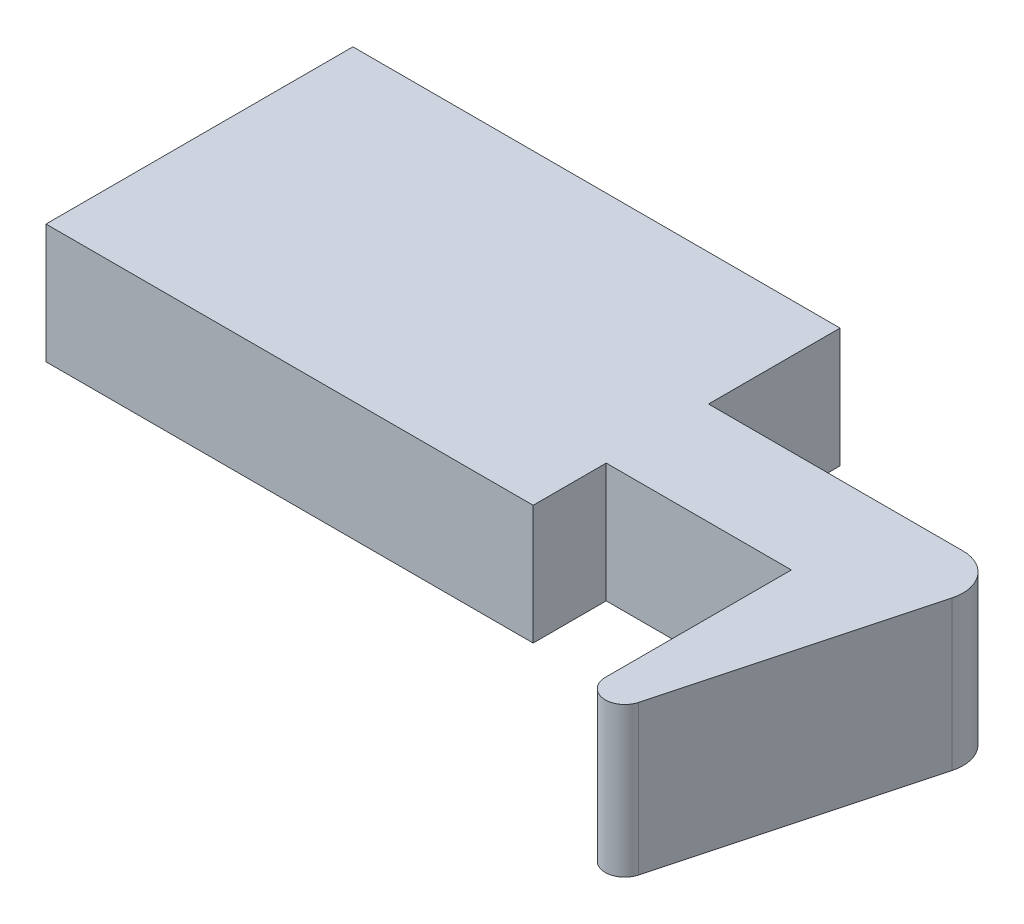
ISO-10303-21;
HEADER;
FILE_DESCRIPTION(('STEP AP214'),'2;1');
FILE_NAME('part.step','',(''),(''),'','','');
FILE_SCHEMA(('AUTOMOTIVE_DESIGN { 1 0 10303 214 1 1 1 1 }'));
ENDSEC;
DATA;
#1=APPLICATION_CONTEXT('core data for automotive mechanical design processes');
#2=APPLICATION_PROTOCOL_DEFINITION('international standard','automotive_design',2000,#1);
#3=PRODUCT_CONTEXT('',#1,'mechanical');
#4=PRODUCT('Part','Part','',(#3));
#5=PRODUCT_RELATED_PRODUCT_CATEGORY('part','',(#4));
#6=PRODUCT_DEFINITION_FORMATION('','',#4);
#7=PRODUCT_DEFINITION_CONTEXT('part definition',#1,'design');
#8=PRODUCT_DEFINITION('design','',#6,#7);
#9=PRODUCT_DEFINITION_SHAPE('','',#8);
#10=(LENGTH_UNIT() NAMED_UNIT(*) SI_UNIT(.MILLI.,.METRE.));
#11=(NAMED_UNIT(*) PLANE_ANGLE_UNIT() SI_UNIT($,.RADIAN.));
#12=(NAMED_UNIT(*) SI_UNIT($,.STERADIAN.) SOLID_ANGLE_UNIT());
#13=UNCERTAINTY_MEASURE_WITH_UNIT(LENGTH_MEASURE(1.E-05),#10,'distance_accuracy_value','');
#14=(GEOMETRIC_REPRESENTATION_CONTEXT(3) GLOBAL_UNCERTAINTY_ASSIGNED_CONTEXT((#13)) GLOBAL_UNIT_ASSIGNED_CONTEXT((#10,
#11,#12)) REPRESENTATION_CONTEXT('',''));
#15=CARTESIAN_POINT('',(0.,0.,0.));
#16=DIRECTION('',(0.,0.,1.));
#17=DIRECTION('',(1.,0.,0.));
#18=AXIS2_PLACEMENT_3D('',#15,#16,#17);
#19=CARTESIAN_POINT('',(0.,0.,0.));
#20=DIRECTION('',(0.,1.,0.));
#21=DIRECTION('',(0.,0.,1.));
#22=AXIS2_PLACEMENT_3D('',#19,#20,#21);
#23=PLANE('',#22);
#24=DIRECTION('',(0.,0.,-1.));
#25=VECTOR('',#24,1.);
#26=CARTESIAN_POINT('',(0.,0.,0.));
#27=LINE('',#26,#25);
#28=CARTESIAN_POINT('',(0.,0.,0.));
#29=VERTEX_POINT('',#28);
#30=CARTESIAN_POINT('',(0.,0.,-5.334));
#31=VERTEX_POINT('',#30);
#32=EDGE_CURVE('E152',#29,#31,#27,.T.);
#33=ORIENTED_EDGE('',*,*,#32,.F.);
#34=DIRECTION('',(-1.,0.,0.));
#35=VECTOR('',#34,1.);
#36=CARTESIAN_POINT('',(0.,0.,0.));
#37=LINE('',#36,#35);
#38=CARTESIAN_POINT('',(-9.652,0.,0.));
#39=VERTEX_POINT('',#38);
#40=EDGE_CURVE('E201',#29,#39,#37,.T.);
#41=ORIENTED_EDGE('',*,*,#40,.T.);
#42=DIRECTION('',(0.,0.,-1.));
#43=VECTOR('',#42,1.);
#44=CARTESIAN_POINT('',(-9.652,0.,0.));
#45=LINE('',#44,#43);
#46=CARTESIAN_POINT('',(-9.652,0.,3.81));
#47=VERTEX_POINT('',#46);
#48=EDGE_CURVE('E197',#47,#39,#45,.T.);
#49=ORIENTED_EDGE('',*,*,#48,.F.);
#50=DIRECTION('',(-1.,0.,0.));
#51=VECTOR('',#50,1.);
#52=CARTESIAN_POINT('',(0.,0.,3.81));
#53=LINE('',#52,#51);
#54=CARTESIAN_POINT('',(-35.052,0.,3.81));
#55=VERTEX_POINT('',#54);
#56=EDGE_CURVE('E159',#47,#55,#53,.T.);
#57=ORIENTED_EDGE('',*,*,#56,.T.);
#58=DIRECTION('',(0.,0.,-1.));
#59=VECTOR('',#58,1.);
#60=CARTESIAN_POINT('',(-35.052,0.,0.));
#61=LINE('',#60,#59);
#62=CARTESIAN_POINT('',(-35.052,0.,-12.192));
#63=VERTEX_POINT('',#62);
#64=EDGE_CURVE('E154',#55,#63,#61,.T.);
#65=ORIENTED_EDGE('',*,*,#64,.T.);
#66=DIRECTION('',(-1.,0.,0.));
#67=VECTOR('',#66,1.);
#68=CARTESIAN_POINT('',(0.,0.,-12.192));
#69=LINE('',#68,#67);
#70=CARTESIAN_POINT('',(-9.652,0.,-12.192));
#71=VERTEX_POINT('',#70);
#72=EDGE_CURVE('E169',#71,#63,#69,.T.);
#73=ORIENTED_EDGE('',*,*,#72,.F.);
#74=CARTESIAN_POINT('',(-9.652,0.,-5.334));
#75=VERTEX_POINT('',#74);
#76=EDGE_CURVE('E202',#75,#71,#45,.T.);
#77=ORIENTED_EDGE('',*,*,#76,.F.);
#78=DIRECTION('',(-1.,0.,0.));
#79=VECTOR('',#78,1.);
#80=CARTESIAN_POINT('',(0.,0.,-5.334));
#81=LINE('',#80,#79);
#82=EDGE_CURVE('E206',#31,#75,#81,.T.);
#83=ORIENTED_EDGE('',*,*,#82,.F.);
#84=EDGE_LOOP('',(#33,#41,#49,#57,#65,#73,#77,#83));
#85=FACE_BOUND('',#84,.T.);
#86=ADVANCED_FACE('F41',(#85),#23,.F.);
#87=CARTESIAN_POINT('',(-35.052,6.223,0.));
#88=DIRECTION('',(-1.,0.,0.));
#89=DIRECTION('',(0.,0.,1.));
#90=AXIS2_PLACEMENT_3D('',#87,#88,#89);
#91=PLANE('',#90);
#92=ORIENTED_EDGE('',*,*,#64,.F.);
#93=DIRECTION('',(0.,-1.,0.));
#94=VECTOR('',#93,1.);
#95=CARTESIAN_POINT('',(-35.052,6.223,3.81));
#96=LINE('',#95,#94);
#97=CARTESIAN_POINT('',(-35.052,6.223,3.81));
#98=VERTEX_POINT('',#97);
#99=EDGE_CURVE('E231',#98,#55,#96,.T.);
#100=ORIENTED_EDGE('',*,*,#99,.F.);
#101=DIRECTION('',(0.,0.,-1.));
#102=VECTOR('',#101,1.);
#103=CARTESIAN_POINT('',(-35.052,6.223,0.));
#104=LINE('',#103,#102);
#105=CARTESIAN_POINT('',(-35.052,6.223,-12.192));
#106=VERTEX_POINT('',#105);
#107=EDGE_CURVE('E164',#98,#106,#104,.T.);
#108=ORIENTED_EDGE('',*,*,#107,.T.);
#109=DIRECTION('',(0.,-1.,0.));
#110=VECTOR('',#109,1.);
#111=CARTESIAN_POINT('',(-35.052,6.223,-12.192));
#112=LINE('',#111,#110);
#113=EDGE_CURVE('E192',#106,#63,#112,.T.);
#114=ORIENTED_EDGE('',*,*,#113,.T.);
#115=EDGE_LOOP('',(#92,#100,#108,#114));
#116=FACE_BOUND('',#115,.T.);
#117=ADVANCED_FACE('F268',(#116),#91,.T.);
#118=CARTESIAN_POINT('',(0.,6.223,3.81));
#119=DIRECTION('',(0.,0.,1.));
#120=DIRECTION('',(1.,0.,0.));
#121=AXIS2_PLACEMENT_3D('',#118,#119,#120);
#122=PLANE('',#121);
#123=ORIENTED_EDGE('',*,*,#56,.F.);
#124=DIRECTION('',(0.,-1.,0.));
#125=VECTOR('',#124,1.);
#126=CARTESIAN_POINT('',(-9.652,6.223,3.81));
#127=LINE('',#126,#125);
#128=CARTESIAN_POINT('',(-9.652,6.223,3.81));
#129=VERTEX_POINT('',#128);
#130=EDGE_CURVE('E228',#129,#47,#127,.T.);
#131=ORIENTED_EDGE('',*,*,#130,.F.);
#132=DIRECTION('',(-1.,0.,0.));
#133=VECTOR('',#132,1.);
#134=CARTESIAN_POINT('',(0.,6.223,3.81));
#135=LINE('',#134,#133);
#136=EDGE_CURVE('E168',#129,#98,#135,.T.);
#137=ORIENTED_EDGE('',*,*,#136,.T.);
#138=ORIENTED_EDGE('',*,*,#99,.T.);
#139=EDGE_LOOP('',(#123,#131,#137,#138));
#140=FACE_BOUND('',#139,.T.);
#141=ADVANCED_FACE('F274',(#140),#122,.T.);
#142=CARTESIAN_POINT('',(-9.652,6.223,0.));
#143=DIRECTION('',(-1.,0.,0.));
#144=DIRECTION('',(0.,0.,1.));
#145=AXIS2_PLACEMENT_3D('',#142,#143,#144);
#146=PLANE('',#145);
#147=ORIENTED_EDGE('',*,*,#48,.T.);
#148=DIRECTION('',(0.,-1.,0.));
#149=VECTOR('',#148,1.);
#150=CARTESIAN_POINT('',(-9.652,6.223,0.));
#151=LINE('',#150,#149);
#152=CARTESIAN_POINT('',(-9.652,6.223,0.));
#153=VERTEX_POINT('',#152);
#154=EDGE_CURVE('E225',#153,#39,#151,.T.);
#155=ORIENTED_EDGE('',*,*,#154,.F.);
#156=DIRECTION('',(0.,0.,-1.));
#157=VECTOR('',#156,1.);
#158=CARTESIAN_POINT('',(-9.652,6.223,0.));
#159=LINE('',#158,#157);
#160=EDGE_CURVE('E173',#129,#153,#159,.T.);
#161=ORIENTED_EDGE('',*,*,#160,.F.);
#162=ORIENTED_EDGE('',*,*,#130,.T.);
#163=EDGE_LOOP('',(#147,#155,#161,#162));
#164=FACE_BOUND('',#163,.T.);
#165=ADVANCED_FACE('F278',(#164),#146,.F.);
#166=CARTESIAN_POINT('',(0.,6.223,0.));
#167=DIRECTION('',(0.,0.,1.));
#168=DIRECTION('',(1.,0.,0.));
#169=AXIS2_PLACEMENT_3D('',#166,#167,#168);
#170=PLANE('',#169);
#171=ORIENTED_EDGE('',*,*,#40,.F.);
#172=DIRECTION('',(0.,-1.,0.));
#173=VECTOR('',#172,1.);
#174=CARTESIAN_POINT('',(0.,6.223,0.));
#175=LINE('',#174,#173);
#176=CARTESIAN_POINT('',(0.,6.223,0.));
#177=VERTEX_POINT('',#176);
#178=EDGE_CURVE('E222',#177,#29,#175,.T.);
#179=ORIENTED_EDGE('',*,*,#178,.F.);
#180=DIRECTION('',(-1.,0.,0.));
#181=VECTOR('',#180,1.);
#182=CARTESIAN_POINT('',(0.,6.223,0.));
#183=LINE('',#182,#181);
#184=EDGE_CURVE('E176',#177,#153,#183,.T.);
#185=ORIENTED_EDGE('',*,*,#184,.T.);
#186=ORIENTED_EDGE('',*,*,#154,.T.);
#187=EDGE_LOOP('',(#171,#179,#185,#186));
#188=FACE_BOUND('',#187,.T.);
#189=ADVANCED_FACE('F285',(#188),#170,.T.);
#190=CARTESIAN_POINT('',(0.,6.223,0.));
#191=DIRECTION('',(-1.,0.,0.));
#192=DIRECTION('',(0.,0.,1.));
#193=AXIS2_PLACEMENT_3D('',#190,#191,#192);
#194=PLANE('',#193);
#195=ORIENTED_EDGE('',*,*,#178,.T.);
#196=ORIENTED_EDGE('',*,*,#32,.T.);
#197=DIRECTION('',(0.,1.,0.));
#198=VECTOR('',#197,1.);
#199=CARTESIAN_POINT('',(0.,-1.5748,-5.334));
#200=LINE('',#199,#198);
#201=CARTESIAN_POINT('',(0.,-1.5748,-5.334));
#202=VERTEX_POINT('',#201);
#203=EDGE_CURVE('E134',#202,#31,#200,.T.);
#204=ORIENTED_EDGE('',*,*,#203,.F.);
#205=DIRECTION('',(0.,0.,-1.));
#206=VECTOR('',#205,1.);
#207=CARTESIAN_POINT('',(0.,-1.5748,0.));
#208=LINE('',#207,#206);
#209=CARTESIAN_POINT('',(0.,-1.5748,9.69929554441088));
#210=VERTEX_POINT('',#209);
#211=EDGE_CURVE('E139',#210,#202,#208,.T.);
#212=ORIENTED_EDGE('',*,*,#211,.F.);
#213=DIRECTION('',(0.,-1.,0.));
#214=VECTOR('',#213,1.);
#215=CARTESIAN_POINT('',(0.,6.223,9.69929554441088));
#216=LINE('',#215,#214);
#217=CARTESIAN_POINT('',(0.,6.223,9.69929554441088));
#218=VERTEX_POINT('',#217);
#219=EDGE_CURVE('E238',#210,#218,#216,.F.);
#220=ORIENTED_EDGE('',*,*,#219,.T.);
#221=DIRECTION('',(0.,0.,-1.));
#222=VECTOR('',#221,1.);
#223=CARTESIAN_POINT('',(0.,6.223,0.));
#224=LINE('',#223,#222);
#225=EDGE_CURVE('E181',#218,#177,#224,.T.);
#226=ORIENTED_EDGE('',*,*,#225,.T.);
#227=EDGE_LOOP('',(#195,#196,#204,#212,#220,#226));
#228=FACE_BOUND('',#227,.T.);
#229=ADVANCED_FACE('F151',(#228),#194,.T.);
#230=CARTESIAN_POINT('',(4.35414543073494,6.223,1.16668975189311));
#231=DIRECTION('',(0.965925826289067,0.,0.258819045102525));
#232=DIRECTION('',(0.258819045102525,0.,-0.965925826289067));
#233=AXIS2_PLACEMENT_3D('',#230,#231,#232);
#234=PLANE('',#233);
#235=DIRECTION('',(-0.258819045102525,0.,0.965925826289067));
#236=VECTOR('',#235,1.);
#237=CARTESIAN_POINT('',(4.35414543073494,-1.5748,1.16668975189311));
#238=LINE('',#237,#236);
#239=CARTESIAN_POINT('',(5.45344436381817,-1.5748,-2.93594971907969));
#240=VERTEX_POINT('',#239);
#241=CARTESIAN_POINT('',(1.99738063950969,-1.5748,9.96225569423504));
#242=VERTEX_POINT('',#241);
#243=EDGE_CURVE('E138',#240,#242,#238,.T.);
#244=ORIENTED_EDGE('',*,*,#243,.F.);
#245=DIRECTION('',(0.,-1.,0.));
#246=VECTOR('',#245,1.);
#247=CARTESIAN_POINT('',(5.45344436381817,6.223,-2.93594971907969));
#248=LINE('',#247,#246);
#249=CARTESIAN_POINT('',(5.45344436381817,6.223,-2.93594971907969));
#250=VERTEX_POINT('',#249);
#251=EDGE_CURVE('E50',#240,#250,#248,.F.);
#252=ORIENTED_EDGE('',*,*,#251,.T.);
#253=DIRECTION('',(-0.258819045102525,0.,0.965925826289067));
#254=VECTOR('',#253,1.);
#255=CARTESIAN_POINT('',(4.35414543073494,6.223,1.16668975189311));
#256=LINE('',#255,#254);
#257=CARTESIAN_POINT('',(1.99738063950969,6.223,9.96225569423504));
#258=VERTEX_POINT('',#257);
#259=EDGE_CURVE('E184',#250,#258,#256,.T.);
#260=ORIENTED_EDGE('',*,*,#259,.T.);
#261=DIRECTION('',(0.,-1.,0.));
#262=VECTOR('',#261,1.);
#263=CARTESIAN_POINT('',(1.99738063950969,6.223,9.96225569423504));
#264=LINE('',#263,#262);
#265=EDGE_CURVE('E234',#258,#242,#264,.T.);
#266=ORIENTED_EDGE('',*,*,#265,.T.);
#267=EDGE_LOOP('',(#244,#252,#260,#266));
#268=FACE_BOUND('',#267,.T.);
#269=ADVANCED_FACE('F310',(#268),#234,.T.);
#270=CARTESIAN_POINT('',(0.,6.223,-5.334));
#271=DIRECTION('',(0.,0.,1.));
#272=DIRECTION('',(1.,0.,0.));
#273=AXIS2_PLACEMENT_3D('',#270,#271,#272);
#274=PLANE('',#273);
#275=DIRECTION('',(-1.,0.,0.));
#276=VECTOR('',#275,1.);
#277=CARTESIAN_POINT('',(0.,6.223,-5.334));
#278=LINE('',#277,#276);
#279=CARTESIAN_POINT('',(3.61335566473749,6.223,-5.334));
#280=VERTEX_POINT('',#279);
#281=CARTESIAN_POINT('',(-9.652,6.223,-5.334));
#282=VERTEX_POINT('',#281);
#283=EDGE_CURVE('E187',#280,#282,#278,.T.);
#284=ORIENTED_EDGE('',*,*,#283,.F.);
#285=DIRECTION('',(0.,-1.,0.));
#286=VECTOR('',#285,1.);
#287=CARTESIAN_POINT('',(3.61335566473749,-1.5748,-5.334));
#288=LINE('',#287,#286);
#289=CARTESIAN_POINT('',(3.61335566473749,-1.5748,-5.334));
#290=VERTEX_POINT('',#289);
#291=EDGE_CURVE('E136',#280,#290,#288,.T.);
#292=ORIENTED_EDGE('',*,*,#291,.T.);
#293=DIRECTION('',(1.,0.,0.));
#294=VECTOR('',#293,1.);
#295=CARTESIAN_POINT('',(0.,-1.5748,-5.334));
#296=LINE('',#295,#294);
#297=EDGE_CURVE('E129',#202,#290,#296,.T.);
#298=ORIENTED_EDGE('',*,*,#297,.F.);
#299=ORIENTED_EDGE('',*,*,#203,.T.);
#300=ORIENTED_EDGE('',*,*,#82,.T.);
#301=DIRECTION('',(0.,-1.,0.));
#302=VECTOR('',#301,1.);
#303=CARTESIAN_POINT('',(-9.652,6.223,-5.334));
#304=LINE('',#303,#302);
#305=EDGE_CURVE('E218',#282,#75,#304,.T.);
#306=ORIENTED_EDGE('',*,*,#305,.F.);
#307=EDGE_LOOP('',(#284,#292,#298,#299,#300,#306));
#308=FACE_BOUND('',#307,.T.);
#309=ADVANCED_FACE('F132',(#308),#274,.F.);
#310=ORIENTED_EDGE('',*,*,#76,.T.);
#311=DIRECTION('',(0.,-1.,0.));
#312=VECTOR('',#311,1.);
#313=CARTESIAN_POINT('',(-9.652,6.223,-12.192));
#314=LINE('',#313,#312);
#315=CARTESIAN_POINT('',(-9.652,6.223,-12.192));
#316=VERTEX_POINT('',#315);
#317=EDGE_CURVE('E214',#316,#71,#314,.T.);
#318=ORIENTED_EDGE('',*,*,#317,.F.);
#319=EDGE_CURVE('E177',#282,#316,#159,.T.);
#320=ORIENTED_EDGE('',*,*,#319,.F.);
#321=ORIENTED_EDGE('',*,*,#305,.T.);
#322=EDGE_LOOP('',(#310,#318,#320,#321));
#323=FACE_BOUND('',#322,.T.);
#324=ADVANCED_FACE('F255',(#323),#146,.F.);
#325=CARTESIAN_POINT('',(0.,6.223,-12.192));
#326=DIRECTION('',(0.,0.,1.));
#327=DIRECTION('',(1.,0.,0.));
#328=AXIS2_PLACEMENT_3D('',#325,#326,#327);
#329=PLANE('',#328);
#330=ORIENTED_EDGE('',*,*,#72,.T.);
#331=ORIENTED_EDGE('',*,*,#113,.F.);
#332=DIRECTION('',(-1.,0.,0.));
#333=VECTOR('',#332,1.);
#334=CARTESIAN_POINT('',(0.,6.223,-12.192));
#335=LINE('',#334,#333);
#336=EDGE_CURVE('E190',#316,#106,#335,.T.);
#337=ORIENTED_EDGE('',*,*,#336,.F.);
#338=ORIENTED_EDGE('',*,*,#317,.T.);
#339=EDGE_LOOP('',(#330,#331,#337,#338));
#340=FACE_BOUND('',#339,.T.);
#341=ADVANCED_FACE('F262',(#340),#329,.F.);
#342=CARTESIAN_POINT('',(0.,6.223,0.));
#343=DIRECTION('',(0.,1.,0.));
#344=DIRECTION('',(0.,0.,1.));
#345=AXIS2_PLACEMENT_3D('',#342,#343,#344);
#346=PLANE('',#345);
#347=ORIENTED_EDGE('',*,*,#259,.F.);
#348=CARTESIAN_POINT('',(3.61335566473749,6.223,-3.429));
#349=DIRECTION('',(0.,1.,0.));
#350=DIRECTION('',(0.,0.,1.));
#351=AXIS2_PLACEMENT_3D('',#348,#349,#350);
#352=CIRCLE('',#351,1.905);
#353=EDGE_CURVE('E11',#250,#280,#352,.T.);
#354=ORIENTED_EDGE('',*,*,#353,.T.);
#355=ORIENTED_EDGE('',*,*,#283,.T.);
#356=ORIENTED_EDGE('',*,*,#319,.T.);
#357=ORIENTED_EDGE('',*,*,#336,.T.);
#358=ORIENTED_EDGE('',*,*,#107,.F.);
#359=ORIENTED_EDGE('',*,*,#136,.F.);
#360=ORIENTED_EDGE('',*,*,#160,.T.);
#361=ORIENTED_EDGE('',*,*,#184,.F.);
#362=ORIENTED_EDGE('',*,*,#225,.F.);
#363=CARTESIAN_POINT('',(1.016,6.223,9.69929554441088));
#364=DIRECTION('',(0.,1.,0.));
#365=DIRECTION('',(0.,0.,1.));
#366=AXIS2_PLACEMENT_3D('',#363,#364,#365);
#367=CIRCLE('',#366,1.016);
#368=EDGE_CURVE('E241',#218,#258,#367,.T.);
#369=ORIENTED_EDGE('',*,*,#368,.T.);
#370=EDGE_LOOP('',(#347,#354,#355,#356,#357,#358,#359,#360,#361,#362,#369));
#371=FACE_BOUND('',#370,.T.);
#372=ADVANCED_FACE('F272',(#371),#346,.T.);
#373=CARTESIAN_POINT('',(1.016,6.223,9.69929554441088));
#374=DIRECTION('',(0.,-1.,0.));
#375=DIRECTION('',(0.,0.,-1.));
#376=AXIS2_PLACEMENT_3D('',#373,#374,#375);
#377=CYLINDRICAL_SURFACE('',#376,1.016);
#378=ORIENTED_EDGE('',*,*,#368,.F.);
#379=ORIENTED_EDGE('',*,*,#219,.F.);
#380=CARTESIAN_POINT('',(1.016,-1.5748,9.69929554441088));
#381=DIRECTION('',(0.,-1.,0.));
#382=DIRECTION('',(0.,0.,-1.));
#383=AXIS2_PLACEMENT_3D('',#380,#381,#382);
#384=CIRCLE('',#383,1.016);
#385=EDGE_CURVE('E145',#242,#210,#384,.T.);
#386=ORIENTED_EDGE('',*,*,#385,.F.);
#387=ORIENTED_EDGE('',*,*,#265,.F.);
#388=EDGE_LOOP('',(#378,#379,#386,#387));
#389=FACE_BOUND('',#388,.T.);
#390=ADVANCED_FACE('F287',(#389),#377,.T.);
#391=CARTESIAN_POINT('',(0.,-1.5748,0.));
#392=DIRECTION('',(0.,-1.,0.));
#393=DIRECTION('',(0.,0.,-1.));
#394=AXIS2_PLACEMENT_3D('',#391,#392,#393);
#395=PLANE('',#394);
#396=ORIENTED_EDGE('',*,*,#297,.T.);
#397=CARTESIAN_POINT('',(3.61335566473749,-1.5748,-3.429));
#398=DIRECTION('',(0.,-1.,0.));
#399=DIRECTION('',(0.,0.,-1.));
#400=AXIS2_PLACEMENT_3D('',#397,#398,#399);
#401=CIRCLE('',#400,1.905);
#402=EDGE_CURVE('E64',#290,#240,#401,.T.);
#403=ORIENTED_EDGE('',*,*,#402,.T.);
#404=ORIENTED_EDGE('',*,*,#243,.T.);
#405=ORIENTED_EDGE('',*,*,#385,.T.);
#406=ORIENTED_EDGE('',*,*,#211,.T.);
#407=EDGE_LOOP('',(#396,#403,#404,#405,#406));
#408=FACE_BOUND('',#407,.T.);
#409=ADVANCED_FACE('F143',(#408),#395,.T.);
#410=CARTESIAN_POINT('',(3.61335566473749,6.223,-3.429));
#411=DIRECTION('',(0.,1.,0.));
#412=DIRECTION('',(0.,0.,1.));
#413=AXIS2_PLACEMENT_3D('',#410,#411,#412);
#414=CYLINDRICAL_SURFACE('',#413,1.905);
#415=ORIENTED_EDGE('',*,*,#353,.F.);
#416=ORIENTED_EDGE('',*,*,#251,.F.);
#417=ORIENTED_EDGE('',*,*,#402,.F.);
#418=ORIENTED_EDGE('',*,*,#291,.F.);
#419=EDGE_LOOP('',(#415,#416,#417,#418));
#420=FACE_BOUND('',#419,.T.);
#421=ADVANCED_FACE('F43',(#420),#414,.T.);
#422=CLOSED_SHELL('',(#86,#117,#141,#165,#189,#229,#269,#309,#324,#341,#372,#390,#409,#421));
#423=MANIFOLD_SOLID_BREP('B2',#422);
#424=ADVANCED_BREP_SHAPE_REPRESENTATION('',(#18,#423),#14);
#425=SHAPE_DEFINITION_REPRESENTATION(#9,#424);
ENDSEC;
END-ISO-10303-21;
